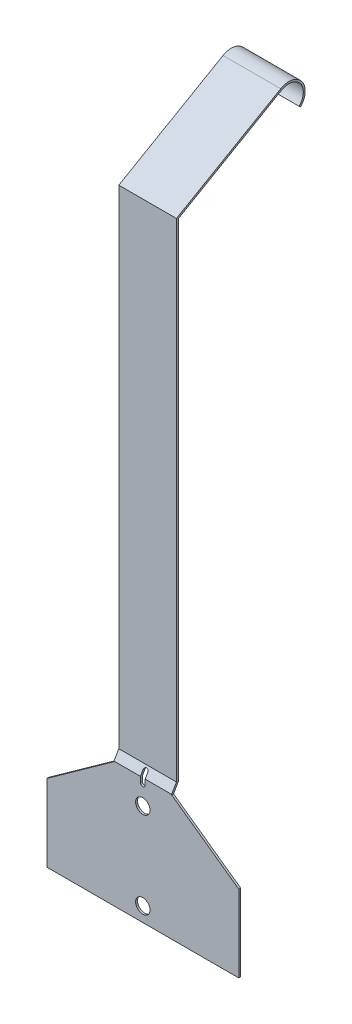
ISO-10303-21;
HEADER;
FILE_DESCRIPTION(('STEP AP214'),'2;1');
FILE_NAME('part.step','',(''),(''),'','','');
FILE_SCHEMA(('AUTOMOTIVE_DESIGN { 1 0 10303 214 1 1 1 1 }'));
ENDSEC;
DATA;
#1=APPLICATION_CONTEXT('core data for automotive mechanical design processes');
#2=APPLICATION_PROTOCOL_DEFINITION('international standard','automotive_design',2000,#1);
#3=PRODUCT_CONTEXT('',#1,'mechanical');
#4=PRODUCT('Part','Part','',(#3));
#5=PRODUCT_RELATED_PRODUCT_CATEGORY('part','',(#4));
#6=PRODUCT_DEFINITION_FORMATION('','',#4);
#7=PRODUCT_DEFINITION_CONTEXT('part definition',#1,'design');
#8=PRODUCT_DEFINITION('design','',#6,#7);
#9=PRODUCT_DEFINITION_SHAPE('','',#8);
#10=(LENGTH_UNIT() NAMED_UNIT(*) SI_UNIT(.MILLI.,.METRE.));
#11=(NAMED_UNIT(*) PLANE_ANGLE_UNIT() SI_UNIT($,.RADIAN.));
#12=(NAMED_UNIT(*) SI_UNIT($,.STERADIAN.) SOLID_ANGLE_UNIT());
#13=UNCERTAINTY_MEASURE_WITH_UNIT(LENGTH_MEASURE(1.E-05),#10,'distance_accuracy_value','');
#14=(GEOMETRIC_REPRESENTATION_CONTEXT(3) GLOBAL_UNCERTAINTY_ASSIGNED_CONTEXT((#13)) GLOBAL_UNIT_ASSIGNED_CONTEXT((#10,
#11,#12)) REPRESENTATION_CONTEXT('',''));
#15=CARTESIAN_POINT('',(0.,0.,0.));
#16=DIRECTION('',(0.,0.,1.));
#17=DIRECTION('',(1.,0.,0.));
#18=AXIS2_PLACEMENT_3D('',#15,#16,#17);
#19=CARTESIAN_POINT('',(38.1,882.65,-152.4));
#20=DIRECTION('',(-1.,0.,0.));
#21=DIRECTION('',(0.,0.,1.));
#22=AXIS2_PLACEMENT_3D('',#19,#20,#21);
#23=CYLINDRICAL_SURFACE('',#22,19.05);
#24=CARTESIAN_POINT('',(-38.1,882.65,-152.4));
#25=DIRECTION('',(-1.,0.,0.));
#26=DIRECTION('',(0.,0.,1.));
#27=AXIS2_PLACEMENT_3D('',#24,#25,#26);
#28=CIRCLE('',#27,19.05);
#29=CARTESIAN_POINT('',(-38.1,899.147783942094,-142.875));
#30=VERTEX_POINT('',#29);
#31=CARTESIAN_POINT('',(-38.1,869.179615818396,-165.870384181604));
#32=VERTEX_POINT('',#31);
#33=EDGE_CURVE('E250',#30,#32,#28,.T.);
#34=ORIENTED_EDGE('',*,*,#33,.T.);
#35=DIRECTION('',(-1.,0.,0.));
#36=VECTOR('',#35,1.);
#37=CARTESIAN_POINT('',(38.1,869.179615818396,-165.870384181604));
#38=LINE('',#37,#36);
#39=CARTESIAN_POINT('',(38.1,869.179615818396,-165.870384181604));
#40=VERTEX_POINT('',#39);
#41=EDGE_CURVE('E343',#40,#32,#38,.T.);
#42=ORIENTED_EDGE('',*,*,#41,.F.);
#43=CARTESIAN_POINT('',(38.1,882.65,-152.4));
#44=DIRECTION('',(-1.,0.,0.));
#45=DIRECTION('',(0.,0.,1.));
#46=AXIS2_PLACEMENT_3D('',#43,#44,#45);
#47=CIRCLE('',#46,19.05);
#48=CARTESIAN_POINT('',(38.1,899.147783942094,-142.875));
#49=VERTEX_POINT('',#48);
#50=EDGE_CURVE('E264',#49,#40,#47,.T.);
#51=ORIENTED_EDGE('',*,*,#50,.F.);
#52=DIRECTION('',(-1.,0.,0.));
#53=VECTOR('',#52,1.);
#54=CARTESIAN_POINT('',(38.1,899.147783942094,-142.875));
#55=LINE('',#54,#53);
#56=EDGE_CURVE('E290',#49,#30,#55,.T.);
#57=ORIENTED_EDGE('',*,*,#56,.T.);
#58=EDGE_LOOP('',(#34,#42,#51,#57));
#59=FACE_BOUND('',#58,.T.);
#60=ADVANCED_FACE('F33',(#59),#23,.F.);
#61=CARTESIAN_POINT('',(38.1,867.383564594182,-167.666435405817));
#62=DIRECTION('',(0.,-0.707106781186537,0.707106781186558));
#63=DIRECTION('',(0.,-0.707106781186558,-0.707106781186537));
#64=AXIS2_PLACEMENT_3D('',#61,#62,#63);
#65=PLANE('',#64);
#66=DIRECTION('',(0.,0.707106781186558,0.707106781186537));
#67=VECTOR('',#66,1.);
#68=CARTESIAN_POINT('',(-38.1,867.383564594182,-167.666435405817));
#69=LINE('',#68,#67);
#70=CARTESIAN_POINT('',(-38.1,867.383564594182,-167.666435405817));
#71=VERTEX_POINT('',#70);
#72=EDGE_CURVE('E293',#71,#32,#69,.T.);
#73=ORIENTED_EDGE('',*,*,#72,.F.);
#74=DIRECTION('',(-1.,0.,0.));
#75=VECTOR('',#74,1.);
#76=CARTESIAN_POINT('',(38.1,867.383564594182,-167.666435405817));
#77=LINE('',#76,#75);
#78=CARTESIAN_POINT('',(38.1,867.383564594182,-167.666435405817));
#79=VERTEX_POINT('',#78);
#80=EDGE_CURVE('E341',#79,#71,#77,.T.);
#81=ORIENTED_EDGE('',*,*,#80,.F.);
#82=DIRECTION('',(0.,0.707106781186558,0.707106781186537));
#83=VECTOR('',#82,1.);
#84=CARTESIAN_POINT('',(38.1,867.383564594182,-167.666435405817));
#85=LINE('',#84,#83);
#86=EDGE_CURVE('E266',#79,#40,#85,.T.);
#87=ORIENTED_EDGE('',*,*,#86,.T.);
#88=ORIENTED_EDGE('',*,*,#41,.T.);
#89=EDGE_LOOP('',(#73,#81,#87,#88));
#90=FACE_BOUND('',#89,.T.);
#91=ADVANCED_FACE('F418',(#90),#65,.T.);
#92=CARTESIAN_POINT('',(38.1,882.65,-152.4));
#93=DIRECTION('',(-1.,0.,0.));
#94=DIRECTION('',(0.,0.,1.));
#95=AXIS2_PLACEMENT_3D('',#92,#93,#94);
#96=CYLINDRICAL_SURFACE('',#95,21.59);
#97=CARTESIAN_POINT('',(-38.1,882.65,-152.4));
#98=DIRECTION('',(1.,0.,0.));
#99=DIRECTION('',(0.,0.,-1.));
#100=AXIS2_PLACEMENT_3D('',#97,#98,#99);
#101=CIRCLE('',#100,21.59);
#102=CARTESIAN_POINT('',(-38.1,901.347488467706,-141.605));
#103=VERTEX_POINT('',#102);
#104=EDGE_CURVE('E296',#103,#71,#101,.F.);
#105=ORIENTED_EDGE('',*,*,#104,.F.);
#106=DIRECTION('',(-1.,0.,0.));
#107=VECTOR('',#106,1.);
#108=CARTESIAN_POINT('',(38.1,901.347488467706,-141.605));
#109=LINE('',#108,#107);
#110=CARTESIAN_POINT('',(38.1,901.347488467706,-141.605));
#111=VERTEX_POINT('',#110);
#112=EDGE_CURVE('E339',#111,#103,#109,.T.);
#113=ORIENTED_EDGE('',*,*,#112,.F.);
#114=CARTESIAN_POINT('',(38.1,882.65,-152.4));
#115=DIRECTION('',(1.,0.,0.));
#116=DIRECTION('',(0.,0.,-1.));
#117=AXIS2_PLACEMENT_3D('',#114,#115,#116);
#118=CIRCLE('',#117,21.59);
#119=EDGE_CURVE('E270',#111,#79,#118,.F.);
#120=ORIENTED_EDGE('',*,*,#119,.T.);
#121=ORIENTED_EDGE('',*,*,#80,.T.);
#122=EDGE_LOOP('',(#105,#113,#120,#121));
#123=FACE_BOUND('',#122,.T.);
#124=ADVANCED_FACE('F414',(#123),#96,.T.);
#125=CARTESIAN_POINT('',(38.1,822.524742966593,-5.08));
#126=DIRECTION('',(0.,0.86602540378444,0.499999999999998));
#127=DIRECTION('',(0.,-0.499999999999998,0.86602540378444));
#128=AXIS2_PLACEMENT_3D('',#125,#126,#127);
#129=PLANE('',#128);
#130=DIRECTION('',(0.,0.499999999999998,-0.86602540378444));
#131=VECTOR('',#130,1.);
#132=CARTESIAN_POINT('',(-38.1,822.524742966593,-5.08));
#133=LINE('',#132,#131);
#134=CARTESIAN_POINT('',(-38.1,821.791508124722,-3.81));
#135=VERTEX_POINT('',#134);
#136=EDGE_CURVE('E299',#135,#103,#133,.T.);
#137=ORIENTED_EDGE('',*,*,#136,.F.);
#138=DIRECTION('',(-1.,0.,0.));
#139=VECTOR('',#138,1.);
#140=CARTESIAN_POINT('',(38.1,821.791508124722,-3.81));
#141=LINE('',#140,#139);
#142=CARTESIAN_POINT('',(38.1,821.791508124722,-3.81));
#143=VERTEX_POINT('',#142);
#144=EDGE_CURVE('E337',#143,#135,#141,.T.);
#145=ORIENTED_EDGE('',*,*,#144,.F.);
#146=DIRECTION('',(0.,0.499999999999998,-0.86602540378444));
#147=VECTOR('',#146,1.);
#148=CARTESIAN_POINT('',(38.1,822.524742966593,-5.08));
#149=LINE('',#148,#147);
#150=EDGE_CURVE('E273',#143,#111,#149,.T.);
#151=ORIENTED_EDGE('',*,*,#150,.T.);
#152=ORIENTED_EDGE('',*,*,#112,.T.);
#153=EDGE_LOOP('',(#137,#145,#151,#152));
#154=FACE_BOUND('',#153,.T.);
#155=ADVANCED_FACE('F410',(#154),#129,.T.);
#156=CARTESIAN_POINT('',(38.1,176.098522628062,-3.81));
#157=DIRECTION('',(0.,0.,1.));
#158=DIRECTION('',(1.,0.,0.));
#159=AXIS2_PLACEMENT_3D('',#156,#157,#158);
#160=PLANE('',#159);
#161=DIRECTION('',(0.,1.,0.));
#162=VECTOR('',#161,1.);
#163=CARTESIAN_POINT('',(-38.1,176.098522628062,-3.81));
#164=LINE('',#163,#162);
#165=CARTESIAN_POINT('',(-38.1,176.779113576837,-3.81));
#166=VERTEX_POINT('',#165);
#167=EDGE_CURVE('E302',#166,#135,#164,.T.);
#168=ORIENTED_EDGE('',*,*,#167,.F.);
#169=DIRECTION('',(-1.,0.,0.));
#170=VECTOR('',#169,1.);
#171=CARTESIAN_POINT('',(38.1,176.779113576837,-3.81));
#172=LINE('',#171,#170);
#173=CARTESIAN_POINT('',(38.1,176.779113576837,-3.81));
#174=VERTEX_POINT('',#173);
#175=EDGE_CURVE('E335',#174,#166,#172,.T.);
#176=ORIENTED_EDGE('',*,*,#175,.F.);
#177=DIRECTION('',(0.,1.,0.));
#178=VECTOR('',#177,1.);
#179=CARTESIAN_POINT('',(38.1,176.098522628062,-3.81));
#180=LINE('',#179,#178);
#181=EDGE_CURVE('E276',#174,#143,#180,.T.);
#182=ORIENTED_EDGE('',*,*,#181,.T.);
#183=ORIENTED_EDGE('',*,*,#144,.T.);
#184=EDGE_LOOP('',(#168,#176,#182,#183));
#185=FACE_BOUND('',#184,.T.);
#186=ADVANCED_FACE('F406',(#185),#160,.T.);
#187=CARTESIAN_POINT('',(38.1,166.37,2.19970452561247));
#188=DIRECTION('',(0.,0.500000000000001,0.866025403784438));
#189=DIRECTION('',(0.,-0.866025403784438,0.500000000000001));
#190=AXIS2_PLACEMENT_3D('',#187,#188,#189);
#191=PLANE('',#190);
#192=DIRECTION('',(0.,-0.866025403784438,0.500000000000001));
#193=VECTOR('',#192,1.);
#194=CARTESIAN_POINT('',(-3.175,166.37,2.19970452561247));
#195=LINE('',#194,#193);
#196=CARTESIAN_POINT('',(-3.175,171.45,-0.73323484187085));
#197=VERTEX_POINT('',#196);
#198=CARTESIAN_POINT('',(-3.175,165.780590948775,2.54));
#199=VERTEX_POINT('',#198);
#200=EDGE_CURVE('E187',#197,#199,#195,.T.);
#201=ORIENTED_EDGE('',*,*,#200,.F.);
#202=CARTESIAN_POINT('',(0.,171.45,-0.73323484187085));
#203=DIRECTION('',(0.,0.500000000000001,0.866025403784438));
#204=DIRECTION('',(0.,-0.866025403784438,0.500000000000001));
#205=AXIS2_PLACEMENT_3D('',#202,#203,#204);
#206=ELLIPSE('',#205,3.66617420935413,3.175);
#207=CARTESIAN_POINT('',(3.175,171.45,-0.733234841870897));
#208=VERTEX_POINT('',#207);
#209=EDGE_CURVE('E207',#208,#197,#206,.T.);
#210=ORIENTED_EDGE('',*,*,#209,.F.);
#211=DIRECTION('',(0.,0.866025403784438,-0.500000000000001));
#212=VECTOR('',#211,1.);
#213=CARTESIAN_POINT('',(3.175,166.37,2.19970452561247));
#214=LINE('',#213,#212);
#215=CARTESIAN_POINT('',(3.175,165.780590948775,2.54));
#216=VERTEX_POINT('',#215);
#217=EDGE_CURVE('E205',#216,#208,#214,.T.);
#218=ORIENTED_EDGE('',*,*,#217,.F.);
#219=DIRECTION('',(-1.,0.,0.));
#220=VECTOR('',#219,1.);
#221=CARTESIAN_POINT('',(38.1,165.780590948775,2.54));
#222=LINE('',#221,#220);
#223=CARTESIAN_POINT('',(38.1,165.780590948775,2.54));
#224=VERTEX_POINT('',#223);
#225=EDGE_CURVE('E333',#224,#216,#222,.T.);
#226=ORIENTED_EDGE('',*,*,#225,.F.);
#227=DIRECTION('',(0.,0.866025403784438,-0.500000000000001));
#228=VECTOR('',#227,1.);
#229=CARTESIAN_POINT('',(38.1,166.37,2.19970452561247));
#230=LINE('',#229,#228);
#231=EDGE_CURVE('E279',#224,#174,#230,.T.);
#232=ORIENTED_EDGE('',*,*,#231,.T.);
#233=ORIENTED_EDGE('',*,*,#175,.T.);
#234=DIRECTION('',(0.,0.866025403784438,-0.500000000000001));
#235=VECTOR('',#234,1.);
#236=CARTESIAN_POINT('',(-38.1,166.37,2.19970452561247));
#237=LINE('',#236,#235);
#238=CARTESIAN_POINT('',(-38.1,165.780590948775,2.54));
#239=VERTEX_POINT('',#238);
#240=EDGE_CURVE('E305',#239,#166,#237,.T.);
#241=ORIENTED_EDGE('',*,*,#240,.F.);
#242=EDGE_CURVE('E332',#199,#239,#222,.T.);
#243=ORIENTED_EDGE('',*,*,#242,.F.);
#244=EDGE_LOOP('',(#201,#210,#218,#226,#232,#233,#241,#243));
#245=FACE_BOUND('',#244,.T.);
#246=ADVANCED_FACE('F386',(#245),#191,.T.);
#247=CARTESIAN_POINT('',(38.1,0.,2.54));
#248=DIRECTION('',(0.,0.,1.));
#249=DIRECTION('',(1.,0.,0.));
#250=AXIS2_PLACEMENT_3D('',#247,#248,#249);
#251=PLANE('',#250);
#252=DIRECTION('',(0.,-1.,0.));
#253=VECTOR('',#252,1.);
#254=CARTESIAN_POINT('',(-3.175,158.75,2.54));
#255=LINE('',#254,#253);
#256=CARTESIAN_POINT('',(-3.175,158.75,2.54));
#257=VERTEX_POINT('',#256);
#258=EDGE_CURVE('E183',#199,#257,#255,.T.);
#259=ORIENTED_EDGE('',*,*,#258,.F.);
#260=ORIENTED_EDGE('',*,*,#242,.T.);
#261=DIRECTION('',(0.,1.,0.));
#262=VECTOR('',#261,1.);
#263=CARTESIAN_POINT('',(-38.1,0.,2.54));
#264=LINE('',#263,#262);
#265=CARTESIAN_POINT('',(-38.1,165.1,2.54));
#266=VERTEX_POINT('',#265);
#267=EDGE_CURVE('E308',#266,#239,#264,.T.);
#268=ORIENTED_EDGE('',*,*,#267,.F.);
#269=DIRECTION('',(0.81334018483385,0.581788401168705,0.));
#270=VECTOR('',#269,1.);
#271=CARTESIAN_POINT('',(-38.1,165.1,2.54));
#272=LINE('',#271,#270);
#273=CARTESIAN_POINT('',(-126.873,101.6,2.54));
#274=VERTEX_POINT('',#273);
#275=EDGE_CURVE('E232',#274,#266,#272,.T.);
#276=ORIENTED_EDGE('',*,*,#275,.F.);
#277=DIRECTION('',(0.,1.,0.));
#278=VECTOR('',#277,1.);
#279=CARTESIAN_POINT('',(-126.873,101.6,2.54));
#280=LINE('',#279,#278);
#281=CARTESIAN_POINT('',(-126.873,0.,2.54));
#282=VERTEX_POINT('',#281);
#283=EDGE_CURVE('E228',#282,#274,#280,.T.);
#284=ORIENTED_EDGE('',*,*,#283,.F.);
#285=DIRECTION('',(-1.,0.,0.));
#286=VECTOR('',#285,1.);
#287=CARTESIAN_POINT('',(38.1,0.,2.54));
#288=LINE('',#287,#286);
#289=CARTESIAN_POINT('',(126.873,0.,2.54));
#290=VERTEX_POINT('',#289);
#291=EDGE_CURVE('E330',#290,#282,#288,.T.);
#292=ORIENTED_EDGE('',*,*,#291,.F.);
#293=DIRECTION('',(0.,-1.,0.));
#294=VECTOR('',#293,1.);
#295=CARTESIAN_POINT('',(126.873,0.,2.54));
#296=LINE('',#295,#294);
#297=CARTESIAN_POINT('',(126.873,101.6,2.54));
#298=VERTEX_POINT('',#297);
#299=EDGE_CURVE('E225',#298,#290,#296,.T.);
#300=ORIENTED_EDGE('',*,*,#299,.F.);
#301=DIRECTION('',(0.81334018483385,-0.581788401168705,0.));
#302=VECTOR('',#301,1.);
#303=CARTESIAN_POINT('',(126.873,101.6,2.54));
#304=LINE('',#303,#302);
#305=CARTESIAN_POINT('',(38.1,165.1,2.54));
#306=VERTEX_POINT('',#305);
#307=EDGE_CURVE('E234',#306,#298,#304,.T.);
#308=ORIENTED_EDGE('',*,*,#307,.F.);
#309=DIRECTION('',(0.,1.,0.));
#310=VECTOR('',#309,1.);
#311=CARTESIAN_POINT('',(38.1,0.,2.54));
#312=LINE('',#311,#310);
#313=EDGE_CURVE('E282',#306,#224,#312,.T.);
#314=ORIENTED_EDGE('',*,*,#313,.T.);
#315=ORIENTED_EDGE('',*,*,#225,.T.);
#316=DIRECTION('',(0.,1.,0.));
#317=VECTOR('',#316,1.);
#318=CARTESIAN_POINT('',(3.175,158.75,2.54));
#319=LINE('',#318,#317);
#320=CARTESIAN_POINT('',(3.175,158.75,2.54));
#321=VERTEX_POINT('',#320);
#322=EDGE_CURVE('E191',#321,#216,#319,.T.);
#323=ORIENTED_EDGE('',*,*,#322,.F.);
#324=CARTESIAN_POINT('',(0.,158.75,2.54));
#325=DIRECTION('',(0.,0.,1.));
#326=DIRECTION('',(1.,0.,0.));
#327=AXIS2_PLACEMENT_3D('',#324,#325,#326);
#328=CIRCLE('',#327,3.175);
#329=EDGE_CURVE('E47',#257,#321,#328,.T.);
#330=ORIENTED_EDGE('',*,*,#329,.F.);
#331=EDGE_LOOP('',(#259,#260,#268,#276,#284,#292,#300,#308,#314,#315,#323,#330));
#332=FACE_BOUND('',#331,.T.);
#333=CARTESIAN_POINT('',(0.,19.05,2.54));
#334=DIRECTION('',(0.,0.,-1.));
#335=DIRECTION('',(-1.,0.,0.));
#336=AXIS2_PLACEMENT_3D('',#333,#334,#335);
#337=CIRCLE('',#336,9.525);
#338=CARTESIAN_POINT('',(-9.525,19.05,2.54));
#339=VERTEX_POINT('',#338);
#340=EDGE_CURVE('E215',#339,#339,#337,.T.);
#341=ORIENTED_EDGE('',*,*,#340,.T.);
#342=EDGE_LOOP('',(#341));
#343=FACE_BOUND('',#342,.T.);
#344=CARTESIAN_POINT('',(0.,133.35,2.54));
#345=DIRECTION('',(0.,0.,-1.));
#346=DIRECTION('',(-1.,0.,0.));
#347=AXIS2_PLACEMENT_3D('',#344,#345,#346);
#348=CIRCLE('',#347,9.525);
#349=CARTESIAN_POINT('',(-9.525,133.35,2.54));
#350=VERTEX_POINT('',#349);
#351=EDGE_CURVE('E221',#350,#350,#348,.T.);
#352=ORIENTED_EDGE('',*,*,#351,.T.);
#353=EDGE_LOOP('',(#352));
#354=FACE_BOUND('',#353,.T.);
#355=ADVANCED_FACE('F194',(#332,#343,#354),#251,.T.);
#356=CARTESIAN_POINT('',(38.1,0.,0.));
#357=DIRECTION('',(0.,-1.,0.));
#358=DIRECTION('',(0.,0.,-1.));
#359=AXIS2_PLACEMENT_3D('',#356,#357,#358);
#360=PLANE('',#359);
#361=ORIENTED_EDGE('',*,*,#291,.T.);
#362=DIRECTION('',(0.,0.,-1.));
#363=VECTOR('',#362,1.);
#364=CARTESIAN_POINT('',(-126.873,0.,2.54));
#365=LINE('',#364,#363);
#366=CARTESIAN_POINT('',(-126.873,0.,0.));
#367=VERTEX_POINT('',#366);
#368=EDGE_CURVE('E259',#282,#367,#365,.T.);
#369=ORIENTED_EDGE('',*,*,#368,.T.);
#370=DIRECTION('',(-1.,0.,0.));
#371=VECTOR('',#370,1.);
#372=CARTESIAN_POINT('',(38.1,0.,0.));
#373=LINE('',#372,#371);
#374=CARTESIAN_POINT('',(126.873,0.,0.));
#375=VERTEX_POINT('',#374);
#376=EDGE_CURVE('E328',#375,#367,#373,.T.);
#377=ORIENTED_EDGE('',*,*,#376,.F.);
#378=DIRECTION('',(0.,0.,-1.));
#379=VECTOR('',#378,1.);
#380=CARTESIAN_POINT('',(126.873,0.,2.54));
#381=LINE('',#380,#379);
#382=EDGE_CURVE('E237',#290,#375,#381,.T.);
#383=ORIENTED_EDGE('',*,*,#382,.F.);
#384=EDGE_LOOP('',(#361,#369,#377,#383));
#385=FACE_BOUND('',#384,.T.);
#386=ADVANCED_FACE('F399',(#385),#360,.T.);
#387=CARTESIAN_POINT('',(38.1,0.,0.));
#388=DIRECTION('',(0.,0.,1.));
#389=DIRECTION('',(1.,0.,0.));
#390=AXIS2_PLACEMENT_3D('',#387,#388,#389);
#391=PLANE('',#390);
#392=CARTESIAN_POINT('',(0.,19.05,0.));
#393=DIRECTION('',(0.,0.,-1.));
#394=DIRECTION('',(-1.,0.,0.));
#395=AXIS2_PLACEMENT_3D('',#392,#393,#394);
#396=CIRCLE('',#395,9.525);
#397=CARTESIAN_POINT('',(-9.525,19.05,0.));
#398=VERTEX_POINT('',#397);
#399=EDGE_CURVE('E212',#398,#398,#396,.T.);
#400=ORIENTED_EDGE('',*,*,#399,.F.);
#401=EDGE_LOOP('',(#400));
#402=FACE_BOUND('',#401,.T.);
#403=CARTESIAN_POINT('',(0.,133.35,0.));
#404=DIRECTION('',(0.,0.,-1.));
#405=DIRECTION('',(-1.,0.,0.));
#406=AXIS2_PLACEMENT_3D('',#403,#404,#405);
#407=CIRCLE('',#406,9.525);
#408=CARTESIAN_POINT('',(-9.525,133.35,0.));
#409=VERTEX_POINT('',#408);
#410=EDGE_CURVE('E218',#409,#409,#407,.T.);
#411=ORIENTED_EDGE('',*,*,#410,.F.);
#412=EDGE_LOOP('',(#411));
#413=FACE_BOUND('',#412,.T.);
#414=DIRECTION('',(-1.,0.,0.));
#415=VECTOR('',#414,1.);
#416=CARTESIAN_POINT('',(38.1,165.1,0.));
#417=LINE('',#416,#415);
#418=CARTESIAN_POINT('',(-3.175,165.1,0.));
#419=VERTEX_POINT('',#418);
#420=CARTESIAN_POINT('',(-38.1,165.1,0.));
#421=VERTEX_POINT('',#420);
#422=EDGE_CURVE('E324',#419,#421,#417,.T.);
#423=ORIENTED_EDGE('',*,*,#422,.F.);
#424=DIRECTION('',(0.,-1.,0.));
#425=VECTOR('',#424,1.);
#426=CARTESIAN_POINT('',(-3.175,0.,0.));
#427=LINE('',#426,#425);
#428=CARTESIAN_POINT('',(-3.175,158.75,0.));
#429=VERTEX_POINT('',#428);
#430=EDGE_CURVE('E209',#419,#429,#427,.T.);
#431=ORIENTED_EDGE('',*,*,#430,.T.);
#432=CARTESIAN_POINT('',(0.,158.75,0.));
#433=DIRECTION('',(0.,0.,1.));
#434=DIRECTION('',(1.,0.,0.));
#435=AXIS2_PLACEMENT_3D('',#432,#433,#434);
#436=CIRCLE('',#435,3.175);
#437=CARTESIAN_POINT('',(3.175,158.75,0.));
#438=VERTEX_POINT('',#437);
#439=EDGE_CURVE('E11',#429,#438,#436,.T.);
#440=ORIENTED_EDGE('',*,*,#439,.T.);
#441=DIRECTION('',(0.,1.,0.));
#442=VECTOR('',#441,1.);
#443=CARTESIAN_POINT('',(3.175,0.,0.));
#444=LINE('',#443,#442);
#445=CARTESIAN_POINT('',(3.175,165.1,0.));
#446=VERTEX_POINT('',#445);
#447=EDGE_CURVE('E179',#438,#446,#444,.T.);
#448=ORIENTED_EDGE('',*,*,#447,.T.);
#449=CARTESIAN_POINT('',(38.1,165.1,0.));
#450=VERTEX_POINT('',#449);
#451=EDGE_CURVE('E325',#450,#446,#417,.T.);
#452=ORIENTED_EDGE('',*,*,#451,.F.);
#453=DIRECTION('',(0.81334018483385,-0.581788401168705,0.));
#454=VECTOR('',#453,1.);
#455=CARTESIAN_POINT('',(126.873,101.6,0.));
#456=LINE('',#455,#454);
#457=CARTESIAN_POINT('',(126.873,101.6,0.));
#458=VERTEX_POINT('',#457);
#459=EDGE_CURVE('E229',#450,#458,#456,.T.);
#460=ORIENTED_EDGE('',*,*,#459,.T.);
#461=DIRECTION('',(0.,-1.,0.));
#462=VECTOR('',#461,1.);
#463=CARTESIAN_POINT('',(126.873,0.,0.));
#464=LINE('',#463,#462);
#465=EDGE_CURVE('E224',#458,#375,#464,.T.);
#466=ORIENTED_EDGE('',*,*,#465,.T.);
#467=ORIENTED_EDGE('',*,*,#376,.T.);
#468=DIRECTION('',(0.,1.,0.));
#469=VECTOR('',#468,1.);
#470=CARTESIAN_POINT('',(-126.873,101.6,0.));
#471=LINE('',#470,#469);
#472=CARTESIAN_POINT('',(-126.873,101.6,0.));
#473=VERTEX_POINT('',#472);
#474=EDGE_CURVE('E240',#367,#473,#471,.T.);
#475=ORIENTED_EDGE('',*,*,#474,.T.);
#476=DIRECTION('',(0.81334018483385,0.581788401168705,0.));
#477=VECTOR('',#476,1.);
#478=CARTESIAN_POINT('',(-38.1,165.1,0.));
#479=LINE('',#478,#477);
#480=EDGE_CURVE('E243',#473,#421,#479,.T.);
#481=ORIENTED_EDGE('',*,*,#480,.T.);
#482=EDGE_LOOP('',(#423,#431,#440,#448,#452,#460,#466,#467,#475,#481));
#483=FACE_BOUND('',#482,.T.);
#484=ADVANCED_FACE('F356',(#402,#413,#483),#391,.F.);
#485=CARTESIAN_POINT('',(38.1,165.1,0.));
#486=DIRECTION('',(0.,0.500000000000001,0.866025403784438));
#487=DIRECTION('',(0.,-0.866025403784438,0.500000000000001));
#488=AXIS2_PLACEMENT_3D('',#485,#486,#487);
#489=PLANE('',#488);
#490=CARTESIAN_POINT('',(0.,171.45,-3.66617420935414));
#491=DIRECTION('',(0.,0.500000000000001,0.866025403784438));
#492=DIRECTION('',(0.,-0.866025403784438,0.500000000000001));
#493=AXIS2_PLACEMENT_3D('',#490,#491,#492);
#494=ELLIPSE('',#493,3.66617420935413,3.175);
#495=CARTESIAN_POINT('',(3.175,171.45,-3.66617420935413));
#496=VERTEX_POINT('',#495);
#497=CARTESIAN_POINT('',(-3.175,171.45,-3.66617420935414));
#498=VERTEX_POINT('',#497);
#499=EDGE_CURVE('E348',#496,#498,#494,.T.);
#500=ORIENTED_EDGE('',*,*,#499,.T.);
#501=DIRECTION('',(0.,-0.866025403784438,0.500000000000001));
#502=VECTOR('',#501,1.);
#503=CARTESIAN_POINT('',(-3.175,165.1,0.));
#504=LINE('',#503,#502);
#505=EDGE_CURVE('E40',#498,#419,#504,.T.);
#506=ORIENTED_EDGE('',*,*,#505,.T.);
#507=ORIENTED_EDGE('',*,*,#422,.T.);
#508=DIRECTION('',(0.,0.866025403784438,-0.500000000000001));
#509=VECTOR('',#508,1.);
#510=CARTESIAN_POINT('',(-38.1,165.1,0.));
#511=LINE('',#510,#509);
#512=CARTESIAN_POINT('',(-38.1,176.098522628062,-6.35));
#513=VERTEX_POINT('',#512);
#514=EDGE_CURVE('E311',#421,#513,#511,.T.);
#515=ORIENTED_EDGE('',*,*,#514,.T.);
#516=DIRECTION('',(-1.,0.,0.));
#517=VECTOR('',#516,1.);
#518=CARTESIAN_POINT('',(38.1,176.098522628062,-6.35));
#519=LINE('',#518,#517);
#520=CARTESIAN_POINT('',(38.1,176.098522628062,-6.35));
#521=VERTEX_POINT('',#520);
#522=EDGE_CURVE('E321',#521,#513,#519,.T.);
#523=ORIENTED_EDGE('',*,*,#522,.F.);
#524=DIRECTION('',(0.,0.866025403784438,-0.500000000000001));
#525=VECTOR('',#524,1.);
#526=CARTESIAN_POINT('',(38.1,165.1,0.));
#527=LINE('',#526,#525);
#528=EDGE_CURVE('E284',#450,#521,#527,.T.);
#529=ORIENTED_EDGE('',*,*,#528,.F.);
#530=ORIENTED_EDGE('',*,*,#451,.T.);
#531=DIRECTION('',(0.,0.866025403784438,-0.500000000000001));
#532=VECTOR('',#531,1.);
#533=CARTESIAN_POINT('',(3.175,165.1,0.));
#534=LINE('',#533,#532);
#535=EDGE_CURVE('E345',#446,#496,#534,.T.);
#536=ORIENTED_EDGE('',*,*,#535,.T.);
#537=EDGE_LOOP('',(#500,#506,#507,#515,#523,#529,#530,#536));
#538=FACE_BOUND('',#537,.T.);
#539=ADVANCED_FACE('F353',(#538),#489,.F.);
#540=CARTESIAN_POINT('',(38.1,176.098522628062,-6.35));
#541=DIRECTION('',(0.,0.,1.));
#542=DIRECTION('',(1.,0.,0.));
#543=AXIS2_PLACEMENT_3D('',#540,#541,#542);
#544=PLANE('',#543);
#545=DIRECTION('',(0.,1.,0.));
#546=VECTOR('',#545,1.);
#547=CARTESIAN_POINT('',(-38.1,176.098522628062,-6.35));
#548=LINE('',#547,#546);
#549=CARTESIAN_POINT('',(-38.1,820.325038440981,-6.35));
#550=VERTEX_POINT('',#549);
#551=EDGE_CURVE('E313',#513,#550,#548,.T.);
#552=ORIENTED_EDGE('',*,*,#551,.T.);
#553=DIRECTION('',(-1.,0.,0.));
#554=VECTOR('',#553,1.);
#555=CARTESIAN_POINT('',(38.1,820.325038440981,-6.35));
#556=LINE('',#555,#554);
#557=CARTESIAN_POINT('',(38.1,820.325038440981,-6.35));
#558=VERTEX_POINT('',#557);
#559=EDGE_CURVE('E318',#558,#550,#556,.T.);
#560=ORIENTED_EDGE('',*,*,#559,.F.);
#561=DIRECTION('',(0.,1.,0.));
#562=VECTOR('',#561,1.);
#563=CARTESIAN_POINT('',(38.1,176.098522628062,-6.35));
#564=LINE('',#563,#562);
#565=EDGE_CURVE('E286',#521,#558,#564,.T.);
#566=ORIENTED_EDGE('',*,*,#565,.F.);
#567=ORIENTED_EDGE('',*,*,#522,.T.);
#568=EDGE_LOOP('',(#552,#560,#566,#567));
#569=FACE_BOUND('',#568,.T.);
#570=ADVANCED_FACE('F372',(#569),#544,.F.);
#571=CARTESIAN_POINT('',(38.1,820.325038440981,-6.35));
#572=DIRECTION('',(0.,0.86602540378444,0.499999999999998));
#573=DIRECTION('',(0.,-0.499999999999998,0.86602540378444));
#574=AXIS2_PLACEMENT_3D('',#571,#572,#573);
#575=PLANE('',#574);
#576=DIRECTION('',(0.,0.499999999999998,-0.86602540378444));
#577=VECTOR('',#576,1.);
#578=CARTESIAN_POINT('',(-38.1,820.325038440981,-6.35));
#579=LINE('',#578,#577);
#580=EDGE_CURVE('E267',#550,#30,#579,.T.);
#581=ORIENTED_EDGE('',*,*,#580,.T.);
#582=ORIENTED_EDGE('',*,*,#56,.F.);
#583=DIRECTION('',(0.,0.499999999999998,-0.86602540378444));
#584=VECTOR('',#583,1.);
#585=CARTESIAN_POINT('',(38.1,820.325038440981,-6.35));
#586=LINE('',#585,#584);
#587=EDGE_CURVE('E288',#558,#49,#586,.T.);
#588=ORIENTED_EDGE('',*,*,#587,.F.);
#589=ORIENTED_EDGE('',*,*,#559,.T.);
#590=EDGE_LOOP('',(#581,#582,#588,#589));
#591=FACE_BOUND('',#590,.T.);
#592=ADVANCED_FACE('F424',(#591),#575,.F.);
#593=CARTESIAN_POINT('',(38.1,882.65,-152.4));
#594=DIRECTION('',(-1.,0.,0.));
#595=DIRECTION('',(0.,0.,1.));
#596=AXIS2_PLACEMENT_3D('',#593,#594,#595);
#597=PLANE('',#596);
#598=ORIENTED_EDGE('',*,*,#313,.F.);
#599=DIRECTION('',(0.,0.,-1.));
#600=VECTOR('',#599,1.);
#601=CARTESIAN_POINT('',(38.1,165.1,2.54));
#602=LINE('',#601,#600);
#603=EDGE_CURVE('E251',#306,#450,#602,.T.);
#604=ORIENTED_EDGE('',*,*,#603,.T.);
#605=ORIENTED_EDGE('',*,*,#528,.T.);
#606=ORIENTED_EDGE('',*,*,#565,.T.);
#607=ORIENTED_EDGE('',*,*,#587,.T.);
#608=ORIENTED_EDGE('',*,*,#50,.T.);
#609=ORIENTED_EDGE('',*,*,#86,.F.);
#610=ORIENTED_EDGE('',*,*,#119,.F.);
#611=ORIENTED_EDGE('',*,*,#150,.F.);
#612=ORIENTED_EDGE('',*,*,#181,.F.);
#613=ORIENTED_EDGE('',*,*,#231,.F.);
#614=EDGE_LOOP('',(#598,#604,#605,#606,#607,#608,#609,#610,#611,#612,#613));
#615=FACE_BOUND('',#614,.T.);
#616=ADVANCED_FACE('F376',(#615),#597,.F.);
#617=CARTESIAN_POINT('',(-38.1,882.65,-152.4));
#618=DIRECTION('',(-1.,0.,0.));
#619=DIRECTION('',(0.,0.,1.));
#620=AXIS2_PLACEMENT_3D('',#617,#618,#619);
#621=PLANE('',#620);
#622=DIRECTION('',(0.,0.,-1.));
#623=VECTOR('',#622,1.);
#624=CARTESIAN_POINT('',(-38.1,165.1,2.54));
#625=LINE('',#624,#623);
#626=EDGE_CURVE('E254',#266,#421,#625,.T.);
#627=ORIENTED_EDGE('',*,*,#626,.F.);
#628=ORIENTED_EDGE('',*,*,#267,.T.);
#629=ORIENTED_EDGE('',*,*,#240,.T.);
#630=ORIENTED_EDGE('',*,*,#167,.T.);
#631=ORIENTED_EDGE('',*,*,#136,.T.);
#632=ORIENTED_EDGE('',*,*,#104,.T.);
#633=ORIENTED_EDGE('',*,*,#72,.T.);
#634=ORIENTED_EDGE('',*,*,#33,.F.);
#635=ORIENTED_EDGE('',*,*,#580,.F.);
#636=ORIENTED_EDGE('',*,*,#551,.F.);
#637=ORIENTED_EDGE('',*,*,#514,.F.);
#638=EDGE_LOOP('',(#627,#628,#629,#630,#631,#632,#633,#634,#635,#636,#637));
#639=FACE_BOUND('',#638,.T.);
#640=ADVANCED_FACE('F367',(#639),#621,.T.);
#641=CARTESIAN_POINT('',(-126.873,101.6,2.54));
#642=DIRECTION('',(-1.,0.,0.));
#643=DIRECTION('',(0.,-1.,0.));
#644=AXIS2_PLACEMENT_3D('',#641,#642,#643);
#645=PLANE('',#644);
#646=ORIENTED_EDGE('',*,*,#474,.F.);
#647=ORIENTED_EDGE('',*,*,#368,.F.);
#648=ORIENTED_EDGE('',*,*,#283,.T.);
#649=DIRECTION('',(0.,0.,-1.));
#650=VECTOR('',#649,1.);
#651=CARTESIAN_POINT('',(-126.873,101.6,2.54));
#652=LINE('',#651,#650);
#653=EDGE_CURVE('E257',#274,#473,#652,.T.);
#654=ORIENTED_EDGE('',*,*,#653,.T.);
#655=EDGE_LOOP('',(#646,#647,#648,#654));
#656=FACE_BOUND('',#655,.T.);
#657=ADVANCED_FACE('F402',(#656),#645,.T.);
#658=CARTESIAN_POINT('',(-38.1,165.1,2.54));
#659=DIRECTION('',(-0.581788401168705,0.81334018483385,0.));
#660=DIRECTION('',(-0.813340184833851,-0.581788401168705,0.));
#661=AXIS2_PLACEMENT_3D('',#658,#659,#660);
#662=PLANE('',#661);
#663=ORIENTED_EDGE('',*,*,#480,.F.);
#664=ORIENTED_EDGE('',*,*,#653,.F.);
#665=ORIENTED_EDGE('',*,*,#275,.T.);
#666=ORIENTED_EDGE('',*,*,#626,.T.);
#667=EDGE_LOOP('',(#663,#664,#665,#666));
#668=FACE_BOUND('',#667,.T.);
#669=ADVANCED_FACE('F362',(#668),#662,.T.);
#670=CARTESIAN_POINT('',(126.873,0.,2.54));
#671=DIRECTION('',(1.,0.,0.));
#672=DIRECTION('',(0.,1.,0.));
#673=AXIS2_PLACEMENT_3D('',#670,#671,#672);
#674=PLANE('',#673);
#675=ORIENTED_EDGE('',*,*,#465,.F.);
#676=DIRECTION('',(0.,0.,-1.));
#677=VECTOR('',#676,1.);
#678=CARTESIAN_POINT('',(126.873,101.6,2.54));
#679=LINE('',#678,#677);
#680=EDGE_CURVE('E248',#298,#458,#679,.T.);
#681=ORIENTED_EDGE('',*,*,#680,.F.);
#682=ORIENTED_EDGE('',*,*,#299,.T.);
#683=ORIENTED_EDGE('',*,*,#382,.T.);
#684=EDGE_LOOP('',(#675,#681,#682,#683));
#685=FACE_BOUND('',#684,.T.);
#686=ADVANCED_FACE('F395',(#685),#674,.T.);
#687=CARTESIAN_POINT('',(126.873,101.6,2.54));
#688=DIRECTION('',(0.581788401168706,0.81334018483385,0.));
#689=DIRECTION('',(-0.81334018483385,0.581788401168705,0.));
#690=AXIS2_PLACEMENT_3D('',#687,#688,#689);
#691=PLANE('',#690);
#692=ORIENTED_EDGE('',*,*,#459,.F.);
#693=ORIENTED_EDGE('',*,*,#603,.F.);
#694=ORIENTED_EDGE('',*,*,#307,.T.);
#695=ORIENTED_EDGE('',*,*,#680,.T.);
#696=EDGE_LOOP('',(#692,#693,#694,#695));
#697=FACE_BOUND('',#696,.T.);
#698=ADVANCED_FACE('F392',(#697),#691,.T.);
#699=CARTESIAN_POINT('',(0.,133.35,0.));
#700=DIRECTION('',(0.,0.,-1.));
#701=DIRECTION('',(-1.,0.,0.));
#702=AXIS2_PLACEMENT_3D('',#699,#700,#701);
#703=CYLINDRICAL_SURFACE('',#702,9.525);
#704=ORIENTED_EDGE('',*,*,#351,.F.);
#705=EDGE_LOOP('',(#704));
#706=FACE_BOUND('',#705,.T.);
#707=ORIENTED_EDGE('',*,*,#410,.T.);
#708=EDGE_LOOP('',(#707));
#709=FACE_BOUND('',#708,.T.);
#710=ADVANCED_FACE('F529',(#706,#709),#703,.F.);
#711=CARTESIAN_POINT('',(0.,19.05,0.));
#712=DIRECTION('',(0.,0.,-1.));
#713=DIRECTION('',(-1.,0.,0.));
#714=AXIS2_PLACEMENT_3D('',#711,#712,#713);
#715=CYLINDRICAL_SURFACE('',#714,9.525);
#716=ORIENTED_EDGE('',*,*,#340,.F.);
#717=EDGE_LOOP('',(#716));
#718=FACE_BOUND('',#717,.T.);
#719=ORIENTED_EDGE('',*,*,#399,.T.);
#720=EDGE_LOOP('',(#719));
#721=FACE_BOUND('',#720,.T.);
#722=ADVANCED_FACE('F538',(#718,#721),#715,.F.);
#723=CARTESIAN_POINT('',(0.,158.75,-173.99));
#724=DIRECTION('',(0.,0.,1.));
#725=DIRECTION('',(1.,0.,0.));
#726=AXIS2_PLACEMENT_3D('',#723,#724,#725);
#727=CYLINDRICAL_SURFACE('',#726,3.175);
#728=DIRECTION('',(0.,0.,1.));
#729=VECTOR('',#728,1.);
#730=CARTESIAN_POINT('',(-3.175,158.75,-173.99));
#731=LINE('',#730,#729);
#732=EDGE_CURVE('E174',#429,#257,#731,.T.);
#733=ORIENTED_EDGE('',*,*,#732,.T.);
#734=ORIENTED_EDGE('',*,*,#329,.T.);
#735=DIRECTION('',(0.,0.,1.));
#736=VECTOR('',#735,1.);
#737=CARTESIAN_POINT('',(3.175,158.75,-173.99));
#738=LINE('',#737,#736);
#739=EDGE_CURVE('E190',#438,#321,#738,.T.);
#740=ORIENTED_EDGE('',*,*,#739,.F.);
#741=ORIENTED_EDGE('',*,*,#439,.F.);
#742=EDGE_LOOP('',(#733,#734,#740,#741));
#743=FACE_BOUND('',#742,.T.);
#744=ADVANCED_FACE('F176',(#743),#727,.F.);
#745=CARTESIAN_POINT('',(-3.175,158.75,-173.99));
#746=DIRECTION('',(-1.,0.,0.));
#747=DIRECTION('',(0.,0.,1.));
#748=AXIS2_PLACEMENT_3D('',#745,#746,#747);
#749=PLANE('',#748);
#750=ORIENTED_EDGE('',*,*,#200,.T.);
#751=ORIENTED_EDGE('',*,*,#258,.T.);
#752=ORIENTED_EDGE('',*,*,#732,.F.);
#753=ORIENTED_EDGE('',*,*,#430,.F.);
#754=ORIENTED_EDGE('',*,*,#505,.F.);
#755=DIRECTION('',(0.,0.,1.));
#756=VECTOR('',#755,1.);
#757=CARTESIAN_POINT('',(-3.175,171.45,-173.99));
#758=LINE('',#757,#756);
#759=EDGE_CURVE('E180',#498,#197,#758,.T.);
#760=ORIENTED_EDGE('',*,*,#759,.T.);
#761=EDGE_LOOP('',(#750,#751,#752,#753,#754,#760));
#762=FACE_BOUND('',#761,.T.);
#763=ADVANCED_FACE('F184',(#762),#749,.F.);
#764=CARTESIAN_POINT('',(0.,171.45,-173.99));
#765=DIRECTION('',(0.,0.,1.));
#766=DIRECTION('',(1.,0.,0.));
#767=AXIS2_PLACEMENT_3D('',#764,#765,#766);
#768=CYLINDRICAL_SURFACE('',#767,3.175);
#769=ORIENTED_EDGE('',*,*,#209,.T.);
#770=ORIENTED_EDGE('',*,*,#759,.F.);
#771=ORIENTED_EDGE('',*,*,#499,.F.);
#772=DIRECTION('',(0.,0.,1.));
#773=VECTOR('',#772,1.);
#774=CARTESIAN_POINT('',(3.175,171.45,-173.99));
#775=LINE('',#774,#773);
#776=EDGE_CURVE('E55',#496,#208,#775,.T.);
#777=ORIENTED_EDGE('',*,*,#776,.T.);
#778=EDGE_LOOP('',(#769,#770,#771,#777));
#779=FACE_BOUND('',#778,.T.);
#780=ADVANCED_FACE('F607',(#779),#768,.F.);
#781=CARTESIAN_POINT('',(3.175,158.75,-173.99));
#782=DIRECTION('',(1.,0.,0.));
#783=DIRECTION('',(0.,0.,-1.));
#784=AXIS2_PLACEMENT_3D('',#781,#782,#783);
#785=PLANE('',#784);
#786=ORIENTED_EDGE('',*,*,#217,.T.);
#787=ORIENTED_EDGE('',*,*,#776,.F.);
#788=ORIENTED_EDGE('',*,*,#535,.F.);
#789=ORIENTED_EDGE('',*,*,#447,.F.);
#790=ORIENTED_EDGE('',*,*,#739,.T.);
#791=ORIENTED_EDGE('',*,*,#322,.T.);
#792=EDGE_LOOP('',(#786,#787,#788,#789,#790,#791));
#793=FACE_BOUND('',#792,.T.);
#794=ADVANCED_FACE('F381',(#793),#785,.F.);
#795=CLOSED_SHELL('',(#60,#91,#124,#155,#186,#246,#355,#386,#484,#539,#570,#592,#616,#640,#657,
#669,#686,#698,#710,#722,#744,#763,#780,#794));
#796=MANIFOLD_SOLID_BREP('B2',#795);
#797=ADVANCED_BREP_SHAPE_REPRESENTATION('',(#18,#796),#14);
#798=SHAPE_DEFINITION_REPRESENTATION(#9,#797);
ENDSEC;
END-ISO-10303-21;
